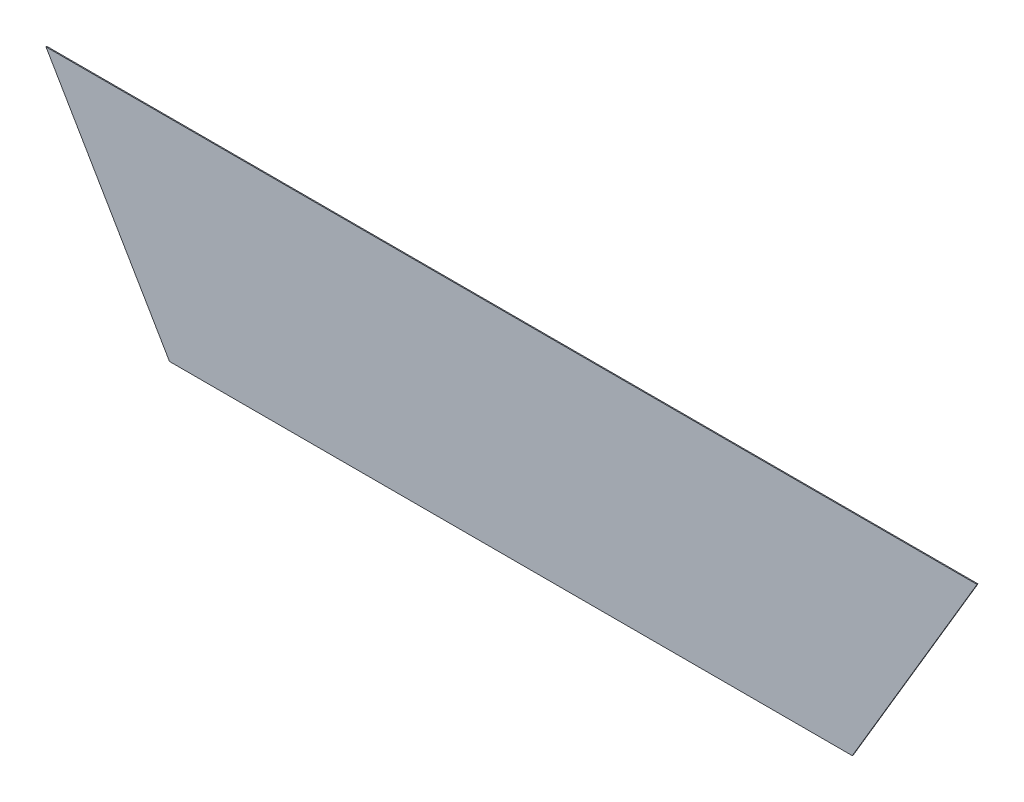
ISO-10303-21;
HEADER;
FILE_DESCRIPTION(('STEP AP214'),'2;1');
FILE_NAME('part.step','',(''),(''),'','','');
FILE_SCHEMA(('AUTOMOTIVE_DESIGN { 1 0 10303 214 1 1 1 1 }'));
ENDSEC;
DATA;
#1=APPLICATION_CONTEXT('core data for automotive mechanical design processes');
#2=APPLICATION_PROTOCOL_DEFINITION('international standard','automotive_design',2000,#1);
#3=PRODUCT_CONTEXT('',#1,'mechanical');
#4=PRODUCT('Part','Part','',(#3));
#5=PRODUCT_RELATED_PRODUCT_CATEGORY('part','',(#4));
#6=PRODUCT_DEFINITION_FORMATION('','',#4);
#7=PRODUCT_DEFINITION_CONTEXT('part definition',#1,'design');
#8=PRODUCT_DEFINITION('design','',#6,#7);
#9=PRODUCT_DEFINITION_SHAPE('','',#8);
#10=(LENGTH_UNIT() NAMED_UNIT(*) SI_UNIT(.MILLI.,.METRE.));
#11=(NAMED_UNIT(*) PLANE_ANGLE_UNIT() SI_UNIT($,.RADIAN.));
#12=(NAMED_UNIT(*) SI_UNIT($,.STERADIAN.) SOLID_ANGLE_UNIT());
#13=UNCERTAINTY_MEASURE_WITH_UNIT(LENGTH_MEASURE(1.E-05),#10,'distance_accuracy_value','');
#14=(GEOMETRIC_REPRESENTATION_CONTEXT(3) GLOBAL_UNCERTAINTY_ASSIGNED_CONTEXT((#13)) GLOBAL_UNIT_ASSIGNED_CONTEXT((#10,
#11,#12)) REPRESENTATION_CONTEXT('',''));
#15=CARTESIAN_POINT('',(0.,0.,0.));
#16=DIRECTION('',(0.,0.,1.));
#17=DIRECTION('',(1.,0.,0.));
#18=AXIS2_PLACEMENT_3D('',#15,#16,#17);
#19=CARTESIAN_POINT('',(-0.235528538424,0.913223785946975,0.00045));
#20=DIRECTION('',(-0.862752742691062,-0.50562605251218,0.));
#21=DIRECTION('',(0.,0.,1.));
#22=AXIS2_PLACEMENT_3D('',#19,#20,#21);
#23=PLANE('',#22);
#24=DIRECTION('',(0.,0.,1.));
#25=VECTOR('',#24,1.);
#26=CARTESIAN_POINT('',(-0.20641634429895,0.86354947584695,0.));
#27=LINE('',#26,#25);
#28=CARTESIAN_POINT('',(-0.20641634429895,0.86354947584695,0.));
#29=VERTEX_POINT('',#28);
#30=CARTESIAN_POINT('',(-0.20641634429895,0.86354947584695,0.00045));
#31=VERTEX_POINT('',#30);
#32=EDGE_CURVE('E11',#29,#31,#27,.T.);
#33=ORIENTED_EDGE('',*,*,#32,.T.);
#34=DIRECTION('',(-0.50562605251218,0.862752742691062,0.));
#35=VECTOR('',#34,1.);
#36=CARTESIAN_POINT('',(-0.20641634429895,0.86354947584695,0.00045));
#37=LINE('',#36,#35);
#38=CARTESIAN_POINT('',(-0.26464073254905,0.962898096047,0.00045));
#39=VERTEX_POINT('',#38);
#40=EDGE_CURVE('E86',#31,#39,#37,.T.);
#41=ORIENTED_EDGE('',*,*,#40,.T.);
#42=DIRECTION('',(0.,0.,1.));
#43=VECTOR('',#42,1.);
#44=CARTESIAN_POINT('',(-0.26464073254905,0.962898096047,0.));
#45=LINE('',#44,#43);
#46=CARTESIAN_POINT('',(-0.26464073254905,0.962898096047,0.));
#47=VERTEX_POINT('',#46);
#48=EDGE_CURVE('E24',#47,#39,#45,.T.);
#49=ORIENTED_EDGE('',*,*,#48,.F.);
#50=DIRECTION('',(-0.50562605251218,0.862752742691062,0.));
#51=VECTOR('',#50,1.);
#52=CARTESIAN_POINT('',(-0.20641634429895,0.86354947584695,0.));
#53=LINE('',#52,#51);
#54=EDGE_CURVE('E80',#29,#47,#53,.T.);
#55=ORIENTED_EDGE('',*,*,#54,.F.);
#56=EDGE_LOOP('',(#33,#41,#49,#55));
#57=FACE_BOUND('',#56,.T.);
#58=ADVANCED_FACE('F17',(#57),#23,.T.);
#59=CARTESIAN_POINT('',(-0.0451418287740002,0.962898096047,0.00045));
#60=DIRECTION('',(0.,1.,0.));
#61=DIRECTION('',(0.,0.,1.));
#62=AXIS2_PLACEMENT_3D('',#59,#60,#61);
#63=PLANE('',#62);
#64=ORIENTED_EDGE('',*,*,#48,.T.);
#65=DIRECTION('',(1.,0.,0.));
#66=VECTOR('',#65,1.);
#67=CARTESIAN_POINT('',(-0.26464073254905,0.962898096047,0.00045));
#68=LINE('',#67,#66);
#69=CARTESIAN_POINT('',(0.17435707500105,0.962898096047,0.00045));
#70=VERTEX_POINT('',#69);
#71=EDGE_CURVE('E64',#39,#70,#68,.T.);
#72=ORIENTED_EDGE('',*,*,#71,.T.);
#73=DIRECTION('',(0.,0.,1.));
#74=VECTOR('',#73,1.);
#75=CARTESIAN_POINT('',(0.17435707500105,0.962898096047,0.));
#76=LINE('',#75,#74);
#77=CARTESIAN_POINT('',(0.17435707500105,0.962898096047,0.));
#78=VERTEX_POINT('',#77);
#79=EDGE_CURVE('E84',#78,#70,#76,.T.);
#80=ORIENTED_EDGE('',*,*,#79,.F.);
#81=DIRECTION('',(1.,0.,0.));
#82=VECTOR('',#81,1.);
#83=CARTESIAN_POINT('',(-0.26464073254905,0.962898096047,0.));
#84=LINE('',#83,#82);
#85=EDGE_CURVE('E72',#47,#78,#84,.T.);
#86=ORIENTED_EDGE('',*,*,#85,.F.);
#87=EDGE_LOOP('',(#64,#72,#80,#86));
#88=FACE_BOUND('',#87,.T.);
#89=ADVANCED_FACE('F91',(#88),#63,.T.);
#90=CARTESIAN_POINT('',(0.14493850290105,0.913223785946975,0.00045));
#91=DIRECTION('',(0.860428671084323,-0.509570899852087,0.));
#92=DIRECTION('',(0.,0.,-1.));
#93=AXIS2_PLACEMENT_3D('',#90,#91,#92);
#94=PLANE('',#93);
#95=ORIENTED_EDGE('',*,*,#79,.T.);
#96=DIRECTION('',(-0.509570899852087,-0.860428671084323,0.));
#97=VECTOR('',#96,1.);
#98=CARTESIAN_POINT('',(0.17435707500105,0.962898096047,0.00045));
#99=LINE('',#98,#97);
#100=CARTESIAN_POINT('',(0.11551993080105,0.86354947584695,0.00045));
#101=VERTEX_POINT('',#100);
#102=EDGE_CURVE('E60',#70,#101,#99,.T.);
#103=ORIENTED_EDGE('',*,*,#102,.T.);
#104=DIRECTION('',(0.,0.,1.));
#105=VECTOR('',#104,1.);
#106=CARTESIAN_POINT('',(0.11551993080105,0.86354947584695,0.));
#107=LINE('',#106,#105);
#108=CARTESIAN_POINT('',(0.11551993080105,0.86354947584695,0.));
#109=VERTEX_POINT('',#108);
#110=EDGE_CURVE('E55',#109,#101,#107,.T.);
#111=ORIENTED_EDGE('',*,*,#110,.F.);
#112=DIRECTION('',(-0.509570899852087,-0.860428671084323,0.));
#113=VECTOR('',#112,1.);
#114=CARTESIAN_POINT('',(0.17435707500105,0.962898096047,0.));
#115=LINE('',#114,#113);
#116=EDGE_CURVE('E58',#78,#109,#115,.T.);
#117=ORIENTED_EDGE('',*,*,#116,.F.);
#118=EDGE_LOOP('',(#95,#103,#111,#117));
#119=FACE_BOUND('',#118,.T.);
#120=ADVANCED_FACE('F57',(#119),#94,.T.);
#121=CARTESIAN_POINT('',(-0.0454482067489502,0.86354947584695,0.00045));
#122=DIRECTION('',(0.,-1.,0.));
#123=DIRECTION('',(0.,0.,-1.));
#124=AXIS2_PLACEMENT_3D('',#121,#122,#123);
#125=PLANE('',#124);
#126=ORIENTED_EDGE('',*,*,#110,.T.);
#127=DIRECTION('',(-1.,0.,0.));
#128=VECTOR('',#127,1.);
#129=CARTESIAN_POINT('',(0.11551993080105,0.86354947584695,0.00045));
#130=LINE('',#129,#128);
#131=EDGE_CURVE('E78',#101,#31,#130,.T.);
#132=ORIENTED_EDGE('',*,*,#131,.T.);
#133=ORIENTED_EDGE('',*,*,#32,.F.);
#134=DIRECTION('',(-1.,0.,0.));
#135=VECTOR('',#134,1.);
#136=CARTESIAN_POINT('',(0.11551993080105,0.86354947584695,0.));
#137=LINE('',#136,#135);
#138=EDGE_CURVE('E71',#109,#29,#137,.T.);
#139=ORIENTED_EDGE('',*,*,#138,.F.);
#140=EDGE_LOOP('',(#126,#132,#133,#139));
#141=FACE_BOUND('',#140,.T.);
#142=ADVANCED_FACE('F74',(#141),#125,.T.);
#143=CARTESIAN_POINT('',(-0.0451418287740002,0.86354947584695,0.));
#144=DIRECTION('',(0.,0.,1.));
#145=DIRECTION('',(1.,0.,0.));
#146=AXIS2_PLACEMENT_3D('',#143,#144,#145);
#147=PLANE('',#146);
#148=ORIENTED_EDGE('',*,*,#54,.T.);
#149=ORIENTED_EDGE('',*,*,#85,.T.);
#150=ORIENTED_EDGE('',*,*,#116,.T.);
#151=ORIENTED_EDGE('',*,*,#138,.T.);
#152=EDGE_LOOP('',(#148,#149,#150,#151));
#153=FACE_BOUND('',#152,.T.);
#154=ADVANCED_FACE('F70',(#153),#147,.F.);
#155=CARTESIAN_POINT('',(-0.0451418287740002,0.86354947584695,0.00045));
#156=DIRECTION('',(0.,0.,1.));
#157=DIRECTION('',(1.,0.,0.));
#158=AXIS2_PLACEMENT_3D('',#155,#156,#157);
#159=PLANE('',#158);
#160=ORIENTED_EDGE('',*,*,#40,.F.);
#161=ORIENTED_EDGE('',*,*,#131,.F.);
#162=ORIENTED_EDGE('',*,*,#102,.F.);
#163=ORIENTED_EDGE('',*,*,#71,.F.);
#164=EDGE_LOOP('',(#160,#161,#162,#163));
#165=FACE_BOUND('',#164,.T.);
#166=ADVANCED_FACE('F90',(#165),#159,.T.);
#167=CLOSED_SHELL('',(#58,#89,#120,#142,#154,#166));
#168=MANIFOLD_SOLID_BREP('B1',#167);
#169=ADVANCED_BREP_SHAPE_REPRESENTATION('',(#18,#168),#14);
#170=SHAPE_DEFINITION_REPRESENTATION(#9,#169);
ENDSEC;
END-ISO-10303-21;
